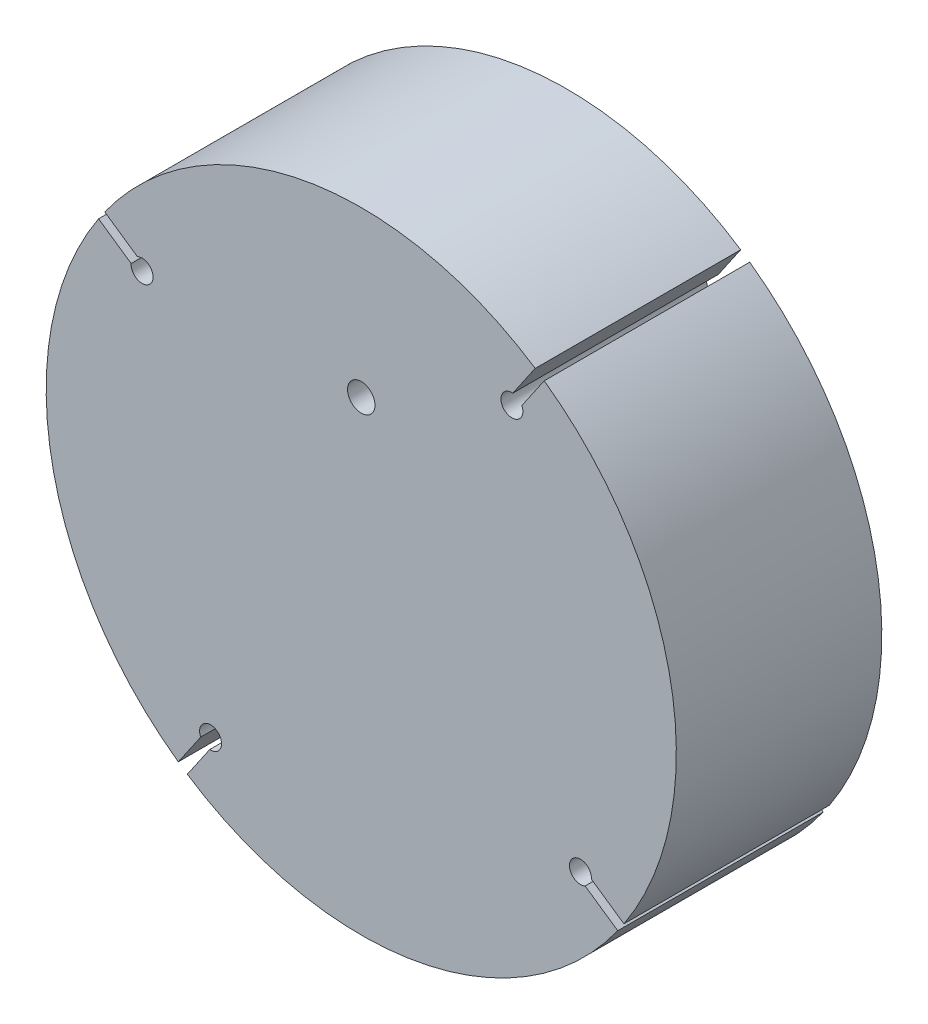
ISO-10303-21;
HEADER;
FILE_DESCRIPTION(('STEP AP214'),'2;1');
FILE_NAME('part.step','',(''),(''),'','','');
FILE_SCHEMA(('AUTOMOTIVE_DESIGN { 1 0 10303 214 1 1 1 1 }'));
ENDSEC;
DATA;
#1=APPLICATION_CONTEXT('core data for automotive mechanical design processes');
#2=APPLICATION_PROTOCOL_DEFINITION('international standard','automotive_design',2000,#1);
#3=PRODUCT_CONTEXT('',#1,'mechanical');
#4=PRODUCT('Part','Part','',(#3));
#5=PRODUCT_RELATED_PRODUCT_CATEGORY('part','',(#4));
#6=PRODUCT_DEFINITION_FORMATION('','',#4);
#7=PRODUCT_DEFINITION_CONTEXT('part definition',#1,'design');
#8=PRODUCT_DEFINITION('design','',#6,#7);
#9=PRODUCT_DEFINITION_SHAPE('','',#8);
#10=(LENGTH_UNIT() NAMED_UNIT(*) SI_UNIT(.MILLI.,.METRE.));
#11=(NAMED_UNIT(*) PLANE_ANGLE_UNIT() SI_UNIT($,.RADIAN.));
#12=(NAMED_UNIT(*) SI_UNIT($,.STERADIAN.) SOLID_ANGLE_UNIT());
#13=UNCERTAINTY_MEASURE_WITH_UNIT(LENGTH_MEASURE(1.E-05),#10,'distance_accuracy_value','');
#14=(GEOMETRIC_REPRESENTATION_CONTEXT(3) GLOBAL_UNCERTAINTY_ASSIGNED_CONTEXT((#13)) GLOBAL_UNIT_ASSIGNED_CONTEXT((#10,
#11,#12)) REPRESENTATION_CONTEXT('',''));
#15=CARTESIAN_POINT('',(0.,0.,0.));
#16=DIRECTION('',(0.,0.,1.));
#17=DIRECTION('',(1.,0.,0.));
#18=AXIS2_PLACEMENT_3D('',#15,#16,#17);
#19=CARTESIAN_POINT('',(0.,0.,75.));
#20=DIRECTION('',(0.,0.,-1.));
#21=DIRECTION('',(-1.,0.,0.));
#22=AXIS2_PLACEMENT_3D('',#19,#20,#21);
#23=CYLINDRICAL_SURFACE('',#22,115.);
#24=CARTESIAN_POINT('',(0.,0.,75.));
#25=DIRECTION('',(0.,0.,1.));
#26=DIRECTION('',(1.,0.,0.));
#27=AXIS2_PLACEMENT_3D('',#24,#25,#26);
#28=CIRCLE('',#27,115.);
#29=CARTESIAN_POINT('',(63.4928773633167,95.8835466809965,75.));
#30=VERTEX_POINT('',#29);
#31=CARTESIAN_POINT('',(-93.6174313894482,66.7890450601141,75.));
#32=VERTEX_POINT('',#31);
#33=EDGE_CURVE('E43',#30,#32,#28,.T.);
#34=ORIENTED_EDGE('',*,*,#33,.F.);
#35=DIRECTION('',(0.,0.,-1.));
#36=VECTOR('',#35,1.);
#37=CARTESIAN_POINT('',(63.4928773633167,95.8835466809965,75.001));
#38=LINE('',#37,#36);
#39=CARTESIAN_POINT('',(63.4928773633167,95.8835466809965,0.));
#40=VERTEX_POINT('',#39);
#41=EDGE_CURVE('E342',#30,#40,#38,.T.);
#42=ORIENTED_EDGE('',*,*,#41,.T.);
#43=CARTESIAN_POINT('',(0.,0.,0.));
#44=DIRECTION('',(0.,0.,1.));
#45=DIRECTION('',(1.,0.,0.));
#46=AXIS2_PLACEMENT_3D('',#43,#44,#45);
#47=CIRCLE('',#46,115.);
#48=CARTESIAN_POINT('',(-93.6174313894482,66.7890450601141,0.));
#49=VERTEX_POINT('',#48);
#50=EDGE_CURVE('E435',#40,#49,#47,.T.);
#51=ORIENTED_EDGE('',*,*,#50,.T.);
#52=DIRECTION('',(0.,0.,-1.));
#53=VECTOR('',#52,1.);
#54=CARTESIAN_POINT('',(-93.6174313894482,66.7890450601141,75.001));
#55=LINE('',#54,#53);
#56=EDGE_CURVE('E393',#32,#49,#55,.T.);
#57=ORIENTED_EDGE('',*,*,#56,.F.);
#58=EDGE_LOOP('',(#34,#42,#51,#57));
#59=FACE_BOUND('',#58,.T.);
#60=ADVANCED_FACE('F33',(#59),#23,.T.);
#61=CARTESIAN_POINT('',(-63.4928773633166,-95.8835466809965,0.));
#62=VERTEX_POINT('',#61);
#63=CARTESIAN_POINT('',(93.6174313894482,-66.7890450601141,0.));
#64=VERTEX_POINT('',#63);
#65=EDGE_CURVE('E37',#62,#64,#47,.T.);
#66=ORIENTED_EDGE('',*,*,#65,.T.);
#67=DIRECTION('',(0.,0.,-1.));
#68=VECTOR('',#67,1.);
#69=CARTESIAN_POINT('',(93.6174313894482,-66.7890450601141,75.001));
#70=LINE('',#69,#68);
#71=CARTESIAN_POINT('',(93.6174313894482,-66.7890450601141,75.));
#72=VERTEX_POINT('',#71);
#73=EDGE_CURVE('E370',#72,#64,#70,.T.);
#74=ORIENTED_EDGE('',*,*,#73,.F.);
#75=CARTESIAN_POINT('',(-63.4928773633166,-95.8835466809965,75.));
#76=VERTEX_POINT('',#75);
#77=EDGE_CURVE('E11',#76,#72,#28,.T.);
#78=ORIENTED_EDGE('',*,*,#77,.F.);
#79=DIRECTION('',(0.,0.,-1.));
#80=VECTOR('',#79,1.);
#81=CARTESIAN_POINT('',(-63.4928773633166,-95.8835466809965,75.001));
#82=LINE('',#81,#80);
#83=EDGE_CURVE('E421',#76,#62,#82,.T.);
#84=ORIENTED_EDGE('',*,*,#83,.T.);
#85=EDGE_LOOP('',(#66,#74,#78,#84));
#86=FACE_BOUND('',#85,.T.);
#87=ADVANCED_FACE('F466',(#86),#23,.T.);
#88=CARTESIAN_POINT('',(-95.8835466809965,63.4928773633167,75.));
#89=VERTEX_POINT('',#88);
#90=CARTESIAN_POINT('',(-66.7890450601141,-93.6174313894483,75.));
#91=VERTEX_POINT('',#90);
#92=EDGE_CURVE('E44',#89,#91,#28,.T.);
#93=ORIENTED_EDGE('',*,*,#92,.F.);
#94=DIRECTION('',(0.,0.,-1.));
#95=VECTOR('',#94,1.);
#96=CARTESIAN_POINT('',(-95.8835466809965,63.4928773633167,75.001));
#97=LINE('',#96,#95);
#98=CARTESIAN_POINT('',(-95.8835466809965,63.4928773633167,0.));
#99=VERTEX_POINT('',#98);
#100=EDGE_CURVE('E394',#89,#99,#97,.T.);
#101=ORIENTED_EDGE('',*,*,#100,.T.);
#102=CARTESIAN_POINT('',(-66.7890450601141,-93.6174313894483,0.));
#103=VERTEX_POINT('',#102);
#104=EDGE_CURVE('E432',#99,#103,#47,.T.);
#105=ORIENTED_EDGE('',*,*,#104,.T.);
#106=DIRECTION('',(0.,0.,-1.));
#107=VECTOR('',#106,1.);
#108=CARTESIAN_POINT('',(-66.7890450601141,-93.6174313894483,75.001));
#109=LINE('',#108,#107);
#110=EDGE_CURVE('E420',#91,#103,#109,.T.);
#111=ORIENTED_EDGE('',*,*,#110,.F.);
#112=EDGE_LOOP('',(#93,#101,#105,#111));
#113=FACE_BOUND('',#112,.T.);
#114=ADVANCED_FACE('F464',(#113),#23,.T.);
#115=CARTESIAN_POINT('',(95.8835466809965,-63.4928773633166,0.));
#116=VERTEX_POINT('',#115);
#117=CARTESIAN_POINT('',(66.7890450601142,93.6174313894482,0.));
#118=VERTEX_POINT('',#117);
#119=EDGE_CURVE('E436',#116,#118,#47,.T.);
#120=ORIENTED_EDGE('',*,*,#119,.T.);
#121=DIRECTION('',(0.,0.,-1.));
#122=VECTOR('',#121,1.);
#123=CARTESIAN_POINT('',(66.7890450601142,93.6174313894482,75.001));
#124=LINE('',#123,#122);
#125=CARTESIAN_POINT('',(66.7890450601142,93.6174313894482,75.));
#126=VERTEX_POINT('',#125);
#127=EDGE_CURVE('E341',#126,#118,#124,.T.);
#128=ORIENTED_EDGE('',*,*,#127,.F.);
#129=CARTESIAN_POINT('',(95.8835466809965,-63.4928773633166,75.));
#130=VERTEX_POINT('',#129);
#131=EDGE_CURVE('E42',#130,#126,#28,.T.);
#132=ORIENTED_EDGE('',*,*,#131,.F.);
#133=DIRECTION('',(0.,0.,-1.));
#134=VECTOR('',#133,1.);
#135=CARTESIAN_POINT('',(95.8835466809965,-63.4928773633166,75.001));
#136=LINE('',#135,#134);
#137=EDGE_CURVE('E372',#130,#116,#136,.T.);
#138=ORIENTED_EDGE('',*,*,#137,.T.);
#139=EDGE_LOOP('',(#120,#128,#132,#138));
#140=FACE_BOUND('',#139,.T.);
#141=ADVANCED_FACE('F35',(#140),#23,.T.);
#142=CARTESIAN_POINT('',(0.,0.,75.));
#143=DIRECTION('',(0.,0.,1.));
#144=DIRECTION('',(1.,0.,0.));
#145=AXIS2_PLACEMENT_3D('',#142,#143,#144);
#146=PLANE('',#145);
#147=CARTESIAN_POINT('',(0.,55.,75.));
#148=DIRECTION('',(0.,0.,-1.));
#149=DIRECTION('',(-1.,0.,0.));
#150=AXIS2_PLACEMENT_3D('',#147,#148,#149);
#151=CIRCLE('',#150,5.);
#152=CARTESIAN_POINT('',(-5.,55.,75.));
#153=VERTEX_POINT('',#152);
#154=EDGE_CURVE('E260',#153,#153,#151,.T.);
#155=ORIENTED_EDGE('',*,*,#154,.T.);
#156=EDGE_LOOP('',(#155));
#157=FACE_BOUND('',#156,.T.);
#158=DIRECTION('',(0.566528822887069,0.824041924199365,0.));
#159=VECTOR('',#158,1.);
#160=CARTESIAN_POINT('',(55.3144295619865,83.9876226063344,75.));
#161=LINE('',#160,#159);
#162=CARTESIAN_POINT('',(55.3144295619865,83.9876226063344,75.));
#163=VERTEX_POINT('',#162);
#164=EDGE_CURVE('E330',#163,#30,#161,.T.);
#165=ORIENTED_EDGE('',*,*,#164,.T.);
#166=ORIENTED_EDGE('',*,*,#33,.T.);
#167=DIRECTION('',(0.824041924199366,-0.566528822887068,0.));
#168=VECTOR('',#167,1.);
#169=CARTESIAN_POINT('',(-81.7215073147861,58.6105972587839,75.));
#170=LINE('',#169,#168);
#171=CARTESIAN_POINT('',(-81.7215073147861,58.6105972587839,75.));
#172=VERTEX_POINT('',#171);
#173=EDGE_CURVE('E397',#32,#172,#170,.T.);
#174=ORIENTED_EDGE('',*,*,#173,.T.);
#175=CARTESIAN_POINT('',(-80.,55.,75.));
#176=DIRECTION('',(0.,0.,1.));
#177=DIRECTION('',(1.,0.,0.));
#178=AXIS2_PLACEMENT_3D('',#175,#176,#177);
#179=CIRCLE('',#178,4.);
#180=CARTESIAN_POINT('',(-83.9876226063344,55.3144295619864,75.));
#181=VERTEX_POINT('',#180);
#182=EDGE_CURVE('E379',#172,#181,#179,.F.);
#183=ORIENTED_EDGE('',*,*,#182,.T.);
#184=DIRECTION('',(-0.824041924199367,0.566528822887066,0.));
#185=VECTOR('',#184,1.);
#186=CARTESIAN_POINT('',(-83.9876226063344,55.3144295619864,75.));
#187=LINE('',#186,#185);
#188=EDGE_CURVE('E382',#181,#89,#187,.T.);
#189=ORIENTED_EDGE('',*,*,#188,.T.);
#190=ORIENTED_EDGE('',*,*,#92,.T.);
#191=DIRECTION('',(0.566528822887061,0.824041924199371,0.));
#192=VECTOR('',#191,1.);
#193=CARTESIAN_POINT('',(-58.6105972587839,-81.7215073147861,75.));
#194=LINE('',#193,#192);
#195=CARTESIAN_POINT('',(-58.6105972587839,-81.7215073147861,75.));
#196=VERTEX_POINT('',#195);
#197=EDGE_CURVE('E424',#91,#196,#194,.T.);
#198=ORIENTED_EDGE('',*,*,#197,.T.);
#199=CARTESIAN_POINT('',(-55.,-80.,75.));
#200=DIRECTION('',(0.,0.,1.));
#201=DIRECTION('',(1.,0.,0.));
#202=AXIS2_PLACEMENT_3D('',#199,#200,#201);
#203=CIRCLE('',#202,4.);
#204=CARTESIAN_POINT('',(-55.3144295619865,-83.9876226063344,75.));
#205=VERTEX_POINT('',#204);
#206=EDGE_CURVE('E406',#196,#205,#203,.F.);
#207=ORIENTED_EDGE('',*,*,#206,.T.);
#208=DIRECTION('',(-0.566528822887061,-0.824041924199371,0.));
#209=VECTOR('',#208,1.);
#210=CARTESIAN_POINT('',(-55.3144295619865,-83.9876226063344,75.));
#211=LINE('',#210,#209);
#212=EDGE_CURVE('E409',#205,#76,#211,.T.);
#213=ORIENTED_EDGE('',*,*,#212,.T.);
#214=ORIENTED_EDGE('',*,*,#77,.T.);
#215=DIRECTION('',(-0.824041924199366,0.566528822887068,0.));
#216=VECTOR('',#215,1.);
#217=CARTESIAN_POINT('',(81.7215073147861,-58.6105972587839,75.));
#218=LINE('',#217,#216);
#219=CARTESIAN_POINT('',(81.7215073147861,-58.6105972587839,75.));
#220=VERTEX_POINT('',#219);
#221=EDGE_CURVE('E356',#72,#220,#218,.T.);
#222=ORIENTED_EDGE('',*,*,#221,.T.);
#223=CARTESIAN_POINT('',(80.,-55.,75.));
#224=DIRECTION('',(0.,0.,1.));
#225=DIRECTION('',(1.,0.,0.));
#226=AXIS2_PLACEMENT_3D('',#223,#224,#225);
#227=CIRCLE('',#226,4.);
#228=CARTESIAN_POINT('',(83.9876226063344,-55.3144295619864,75.));
#229=VERTEX_POINT('',#228);
#230=EDGE_CURVE('E353',#220,#229,#227,.F.);
#231=ORIENTED_EDGE('',*,*,#230,.T.);
#232=DIRECTION('',(0.824041924199367,-0.566528822887066,0.));
#233=VECTOR('',#232,1.);
#234=CARTESIAN_POINT('',(83.9876226063344,-55.3144295619864,75.));
#235=LINE('',#234,#233);
#236=EDGE_CURVE('E369',#229,#130,#235,.T.);
#237=ORIENTED_EDGE('',*,*,#236,.T.);
#238=ORIENTED_EDGE('',*,*,#131,.T.);
#239=DIRECTION('',(-0.56652882288707,-0.824041924199365,0.));
#240=VECTOR('',#239,1.);
#241=CARTESIAN_POINT('',(58.6105972587839,81.7215073147861,75.));
#242=LINE('',#241,#240);
#243=CARTESIAN_POINT('',(58.6105972587839,81.7215073147861,75.));
#244=VERTEX_POINT('',#243);
#245=EDGE_CURVE('E345',#126,#244,#242,.T.);
#246=ORIENTED_EDGE('',*,*,#245,.T.);
#247=CARTESIAN_POINT('',(55.,80.,75.));
#248=DIRECTION('',(0.,0.,1.));
#249=DIRECTION('',(1.,0.,0.));
#250=AXIS2_PLACEMENT_3D('',#247,#248,#249);
#251=CIRCLE('',#250,4.);
#252=EDGE_CURVE('E321',#244,#163,#251,.F.);
#253=ORIENTED_EDGE('',*,*,#252,.T.);
#254=EDGE_LOOP('',(#165,#166,#174,#183,#189,#190,#198,#207,#213,#214,#222,#231,#237,#238,#246,#253));
#255=FACE_BOUND('',#254,.T.);
#256=ADVANCED_FACE('F458',(#157,#255),#146,.T.);
#257=CARTESIAN_POINT('',(0.,0.,0.));
#258=DIRECTION('',(0.,0.,1.));
#259=DIRECTION('',(1.,0.,0.));
#260=AXIS2_PLACEMENT_3D('',#257,#258,#259);
#261=PLANE('',#260);
#262=DIRECTION('',(1.,0.,0.));
#263=VECTOR('',#262,1.);
#264=CARTESIAN_POINT('',(22.5,107.,0.));
#265=LINE('',#264,#263);
#266=CARTESIAN_POINT('',(-22.5,107.,0.));
#267=VERTEX_POINT('',#266);
#268=CARTESIAN_POINT('',(22.5,107.,0.));
#269=VERTEX_POINT('',#268);
#270=EDGE_CURVE('E250',#267,#269,#265,.T.);
#271=ORIENTED_EDGE('',*,*,#270,.F.);
#272=DIRECTION('',(0.,1.,0.));
#273=VECTOR('',#272,1.);
#274=CARTESIAN_POINT('',(-22.5,107.,0.));
#275=LINE('',#274,#273);
#276=CARTESIAN_POINT('',(-22.5,62.,0.));
#277=VERTEX_POINT('',#276);
#278=EDGE_CURVE('E51',#277,#267,#275,.T.);
#279=ORIENTED_EDGE('',*,*,#278,.F.);
#280=DIRECTION('',(-1.,0.,0.));
#281=VECTOR('',#280,1.);
#282=CARTESIAN_POINT('',(22.5,62.,0.));
#283=LINE('',#282,#281);
#284=CARTESIAN_POINT('',(22.5,62.,0.));
#285=VERTEX_POINT('',#284);
#286=EDGE_CURVE('E241',#285,#277,#283,.T.);
#287=ORIENTED_EDGE('',*,*,#286,.F.);
#288=DIRECTION('',(0.,-1.,0.));
#289=VECTOR('',#288,1.);
#290=CARTESIAN_POINT('',(22.5,107.,0.));
#291=LINE('',#290,#289);
#292=EDGE_CURVE('E244',#269,#285,#291,.T.);
#293=ORIENTED_EDGE('',*,*,#292,.F.);
#294=EDGE_LOOP('',(#271,#279,#287,#293));
#295=FACE_BOUND('',#294,.T.);
#296=CARTESIAN_POINT('',(0.,55.,0.));
#297=DIRECTION('',(0.,0.,-1.));
#298=DIRECTION('',(-1.,0.,0.));
#299=AXIS2_PLACEMENT_3D('',#296,#297,#298);
#300=CIRCLE('',#299,5.);
#301=CARTESIAN_POINT('',(-5.,55.,0.));
#302=VERTEX_POINT('',#301);
#303=EDGE_CURVE('E256',#302,#302,#300,.T.);
#304=ORIENTED_EDGE('',*,*,#303,.F.);
#305=EDGE_LOOP('',(#304));
#306=FACE_BOUND('',#305,.T.);
#307=DIRECTION('',(1.,0.,0.));
#308=VECTOR('',#307,1.);
#309=CARTESIAN_POINT('',(-15.,35.,0.));
#310=LINE('',#309,#308);
#311=CARTESIAN_POINT('',(-65.,35.,0.));
#312=VERTEX_POINT('',#311);
#313=CARTESIAN_POINT('',(-15.,35.,0.));
#314=VERTEX_POINT('',#313);
#315=EDGE_CURVE('E280',#312,#314,#310,.T.);
#316=ORIENTED_EDGE('',*,*,#315,.F.);
#317=DIRECTION('',(0.,1.,0.));
#318=VECTOR('',#317,1.);
#319=CARTESIAN_POINT('',(-65.,-35.,0.));
#320=LINE('',#319,#318);
#321=CARTESIAN_POINT('',(-65.,-35.,0.));
#322=VERTEX_POINT('',#321);
#323=EDGE_CURVE('E59',#322,#312,#320,.T.);
#324=ORIENTED_EDGE('',*,*,#323,.F.);
#325=DIRECTION('',(-1.,0.,0.));
#326=VECTOR('',#325,1.);
#327=CARTESIAN_POINT('',(-15.,-35.,0.));
#328=LINE('',#327,#326);
#329=CARTESIAN_POINT('',(-15.,-35.,0.));
#330=VERTEX_POINT('',#329);
#331=EDGE_CURVE('E269',#330,#322,#328,.T.);
#332=ORIENTED_EDGE('',*,*,#331,.F.);
#333=DIRECTION('',(0.,-1.,0.));
#334=VECTOR('',#333,1.);
#335=CARTESIAN_POINT('',(-15.,-35.,0.));
#336=LINE('',#335,#334);
#337=EDGE_CURVE('E283',#314,#330,#336,.T.);
#338=ORIENTED_EDGE('',*,*,#337,.F.);
#339=EDGE_LOOP('',(#316,#324,#332,#338));
#340=FACE_BOUND('',#339,.T.);
#341=DIRECTION('',(-1.,0.,0.));
#342=VECTOR('',#341,1.);
#343=CARTESIAN_POINT('',(5.,-30.,0.));
#344=LINE('',#343,#342);
#345=CARTESIAN_POINT('',(65.,-30.,0.));
#346=VERTEX_POINT('',#345);
#347=CARTESIAN_POINT('',(5.,-30.,0.));
#348=VERTEX_POINT('',#347);
#349=EDGE_CURVE('E311',#346,#348,#344,.T.);
#350=ORIENTED_EDGE('',*,*,#349,.F.);
#351=DIRECTION('',(0.,-1.,0.));
#352=VECTOR('',#351,1.);
#353=CARTESIAN_POINT('',(65.,30.,0.));
#354=LINE('',#353,#352);
#355=CARTESIAN_POINT('',(65.,30.,0.));
#356=VERTEX_POINT('',#355);
#357=EDGE_CURVE('E290',#356,#346,#354,.T.);
#358=ORIENTED_EDGE('',*,*,#357,.F.);
#359=DIRECTION('',(1.,0.,0.));
#360=VECTOR('',#359,1.);
#361=CARTESIAN_POINT('',(5.00000000000001,30.,0.));
#362=LINE('',#361,#360);
#363=CARTESIAN_POINT('',(5.00000000000001,30.,0.));
#364=VERTEX_POINT('',#363);
#365=EDGE_CURVE('E300',#364,#356,#362,.T.);
#366=ORIENTED_EDGE('',*,*,#365,.F.);
#367=DIRECTION('',(0.,1.,0.));
#368=VECTOR('',#367,1.);
#369=CARTESIAN_POINT('',(5.00000000000001,30.,0.));
#370=LINE('',#369,#368);
#371=EDGE_CURVE('E314',#348,#364,#370,.T.);
#372=ORIENTED_EDGE('',*,*,#371,.F.);
#373=EDGE_LOOP('',(#350,#358,#366,#372));
#374=FACE_BOUND('',#373,.T.);
#375=ORIENTED_EDGE('',*,*,#50,.F.);
#376=DIRECTION('',(0.566528822887069,0.824041924199365,0.));
#377=VECTOR('',#376,1.);
#378=CARTESIAN_POINT('',(55.3144295619865,83.9876226063344,0.));
#379=LINE('',#378,#377);
#380=CARTESIAN_POINT('',(55.3144295619865,83.9876226063344,0.));
#381=VERTEX_POINT('',#380);
#382=EDGE_CURVE('E339',#381,#40,#379,.T.);
#383=ORIENTED_EDGE('',*,*,#382,.F.);
#384=CARTESIAN_POINT('',(55.,80.,0.));
#385=DIRECTION('',(0.,0.,-1.));
#386=DIRECTION('',(-1.,0.,0.));
#387=AXIS2_PLACEMENT_3D('',#384,#385,#386);
#388=CIRCLE('',#387,4.);
#389=CARTESIAN_POINT('',(58.6105972587839,81.7215073147861,0.));
#390=VERTEX_POINT('',#389);
#391=EDGE_CURVE('E336',#390,#381,#388,.T.);
#392=ORIENTED_EDGE('',*,*,#391,.F.);
#393=DIRECTION('',(-0.56652882288707,-0.824041924199364,0.));
#394=VECTOR('',#393,1.);
#395=CARTESIAN_POINT('',(58.6105972587839,81.7215073147861,0.));
#396=LINE('',#395,#394);
#397=EDGE_CURVE('E333',#118,#390,#396,.T.);
#398=ORIENTED_EDGE('',*,*,#397,.F.);
#399=ORIENTED_EDGE('',*,*,#119,.F.);
#400=DIRECTION('',(0.824041924199367,-0.566528822887066,0.));
#401=VECTOR('',#400,1.);
#402=CARTESIAN_POINT('',(83.9876226063344,-55.3144295619864,0.));
#403=LINE('',#402,#401);
#404=CARTESIAN_POINT('',(83.9876226063344,-55.3144295619864,0.));
#405=VERTEX_POINT('',#404);
#406=EDGE_CURVE('E361',#405,#116,#403,.T.);
#407=ORIENTED_EDGE('',*,*,#406,.F.);
#408=CARTESIAN_POINT('',(80.,-55.,0.));
#409=DIRECTION('',(0.,0.,-1.));
#410=DIRECTION('',(-1.,0.,0.));
#411=AXIS2_PLACEMENT_3D('',#408,#409,#410);
#412=CIRCLE('',#411,4.);
#413=CARTESIAN_POINT('',(81.7215073147861,-58.6105972587839,0.));
#414=VERTEX_POINT('',#413);
#415=EDGE_CURVE('E359',#414,#405,#412,.T.);
#416=ORIENTED_EDGE('',*,*,#415,.F.);
#417=DIRECTION('',(-0.824041924199366,0.566528822887068,0.));
#418=VECTOR('',#417,1.);
#419=CARTESIAN_POINT('',(81.7215073147861,-58.6105972587839,0.));
#420=LINE('',#419,#418);
#421=EDGE_CURVE('E363',#64,#414,#420,.T.);
#422=ORIENTED_EDGE('',*,*,#421,.F.);
#423=ORIENTED_EDGE('',*,*,#65,.F.);
#424=DIRECTION('',(-0.566528822887061,-0.824041924199371,0.));
#425=VECTOR('',#424,1.);
#426=CARTESIAN_POINT('',(-55.3144295619865,-83.9876226063344,0.));
#427=LINE('',#426,#425);
#428=CARTESIAN_POINT('',(-55.3144295619865,-83.9876226063344,0.));
#429=VERTEX_POINT('',#428);
#430=EDGE_CURVE('E418',#429,#62,#427,.T.);
#431=ORIENTED_EDGE('',*,*,#430,.F.);
#432=CARTESIAN_POINT('',(-55.,-80.,0.));
#433=DIRECTION('',(0.,0.,-1.));
#434=DIRECTION('',(1.,0.,0.));
#435=AXIS2_PLACEMENT_3D('',#432,#433,#434);
#436=CIRCLE('',#435,4.);
#437=CARTESIAN_POINT('',(-58.6105972587839,-81.7215073147861,0.));
#438=VERTEX_POINT('',#437);
#439=EDGE_CURVE('E415',#438,#429,#436,.T.);
#440=ORIENTED_EDGE('',*,*,#439,.F.);
#441=DIRECTION('',(0.566528822887061,0.82404192419937,0.));
#442=VECTOR('',#441,1.);
#443=CARTESIAN_POINT('',(-58.6105972587839,-81.7215073147861,0.));
#444=LINE('',#443,#442);
#445=EDGE_CURVE('E412',#103,#438,#444,.T.);
#446=ORIENTED_EDGE('',*,*,#445,.F.);
#447=ORIENTED_EDGE('',*,*,#104,.F.);
#448=DIRECTION('',(-0.824041924199367,0.566528822887066,0.));
#449=VECTOR('',#448,1.);
#450=CARTESIAN_POINT('',(-83.9876226063344,55.3144295619864,0.));
#451=LINE('',#450,#449);
#452=CARTESIAN_POINT('',(-83.9876226063344,55.3144295619864,0.));
#453=VERTEX_POINT('',#452);
#454=EDGE_CURVE('E391',#453,#99,#451,.T.);
#455=ORIENTED_EDGE('',*,*,#454,.F.);
#456=CARTESIAN_POINT('',(-80.,55.,0.));
#457=DIRECTION('',(0.,0.,-1.));
#458=DIRECTION('',(-1.,0.,0.));
#459=AXIS2_PLACEMENT_3D('',#456,#457,#458);
#460=CIRCLE('',#459,4.);
#461=CARTESIAN_POINT('',(-81.7215073147861,58.6105972587839,0.));
#462=VERTEX_POINT('',#461);
#463=EDGE_CURVE('E388',#462,#453,#460,.T.);
#464=ORIENTED_EDGE('',*,*,#463,.F.);
#465=DIRECTION('',(0.824041924199366,-0.566528822887068,0.));
#466=VECTOR('',#465,1.);
#467=CARTESIAN_POINT('',(-81.7215073147861,58.6105972587839,0.));
#468=LINE('',#467,#466);
#469=EDGE_CURVE('E385',#49,#462,#468,.T.);
#470=ORIENTED_EDGE('',*,*,#469,.F.);
#471=EDGE_LOOP('',(#375,#383,#392,#398,#399,#407,#416,#422,#423,#431,#440,#446,#447,#455,#464,#470));
#472=FACE_BOUND('',#471,.T.);
#473=ADVANCED_FACE('F451',(#295,#306,#340,#374,#472),#261,.F.);
#474=CARTESIAN_POINT('',(-55.3144295619865,-83.9876226063344,75.001));
#475=DIRECTION('',(0.824041924199371,-0.566528822887061,0.));
#476=DIRECTION('',(0.566528822887061,0.824041924199371,0.));
#477=AXIS2_PLACEMENT_3D('',#474,#475,#476);
#478=PLANE('',#477);
#479=DIRECTION('',(0.,0.,-1.));
#480=VECTOR('',#479,1.);
#481=CARTESIAN_POINT('',(-55.3144295619865,-83.9876226063344,75.001));
#482=LINE('',#481,#480);
#483=EDGE_CURVE('E425',#205,#429,#482,.T.);
#484=ORIENTED_EDGE('',*,*,#483,.T.);
#485=ORIENTED_EDGE('',*,*,#430,.T.);
#486=ORIENTED_EDGE('',*,*,#83,.F.);
#487=ORIENTED_EDGE('',*,*,#212,.F.);
#488=EDGE_LOOP('',(#484,#485,#486,#487));
#489=FACE_BOUND('',#488,.T.);
#490=ADVANCED_FACE('F529',(#489),#478,.F.);
#491=CARTESIAN_POINT('',(-55.,-80.,75.001));
#492=DIRECTION('',(0.,0.,-1.));
#493=DIRECTION('',(-1.,0.,0.));
#494=AXIS2_PLACEMENT_3D('',#491,#492,#493);
#495=CYLINDRICAL_SURFACE('',#494,4.);
#496=DIRECTION('',(0.,0.,-1.));
#497=VECTOR('',#496,1.);
#498=CARTESIAN_POINT('',(-58.6105972587839,-81.7215073147861,75.001));
#499=LINE('',#498,#497);
#500=EDGE_CURVE('E427',#196,#438,#499,.T.);
#501=ORIENTED_EDGE('',*,*,#500,.T.);
#502=ORIENTED_EDGE('',*,*,#439,.T.);
#503=ORIENTED_EDGE('',*,*,#483,.F.);
#504=ORIENTED_EDGE('',*,*,#206,.F.);
#505=EDGE_LOOP('',(#501,#502,#503,#504));
#506=FACE_BOUND('',#505,.T.);
#507=ADVANCED_FACE('F495',(#506),#495,.F.);
#508=CARTESIAN_POINT('',(-58.6105972587839,-81.7215073147861,75.001));
#509=DIRECTION('',(-0.824041924199371,0.566528822887061,0.));
#510=DIRECTION('',(-0.566528822887061,-0.824041924199371,0.));
#511=AXIS2_PLACEMENT_3D('',#508,#509,#510);
#512=PLANE('',#511);
#513=ORIENTED_EDGE('',*,*,#110,.T.);
#514=ORIENTED_EDGE('',*,*,#445,.T.);
#515=ORIENTED_EDGE('',*,*,#500,.F.);
#516=ORIENTED_EDGE('',*,*,#197,.F.);
#517=EDGE_LOOP('',(#513,#514,#515,#516));
#518=FACE_BOUND('',#517,.T.);
#519=ADVANCED_FACE('F462',(#518),#512,.F.);
#520=CARTESIAN_POINT('',(-83.9876226063344,55.3144295619864,75.001));
#521=DIRECTION('',(-0.566528822887066,-0.824041924199367,0.));
#522=DIRECTION('',(0.824041924199367,-0.566528822887066,0.));
#523=AXIS2_PLACEMENT_3D('',#520,#521,#522);
#524=PLANE('',#523);
#525=DIRECTION('',(0.,0.,-1.));
#526=VECTOR('',#525,1.);
#527=CARTESIAN_POINT('',(-83.9876226063344,55.3144295619864,75.001));
#528=LINE('',#527,#526);
#529=EDGE_CURVE('E398',#181,#453,#528,.T.);
#530=ORIENTED_EDGE('',*,*,#529,.T.);
#531=ORIENTED_EDGE('',*,*,#454,.T.);
#532=ORIENTED_EDGE('',*,*,#100,.F.);
#533=ORIENTED_EDGE('',*,*,#188,.F.);
#534=EDGE_LOOP('',(#530,#531,#532,#533));
#535=FACE_BOUND('',#534,.T.);
#536=ADVANCED_FACE('F489',(#535),#524,.F.);
#537=CARTESIAN_POINT('',(-80.,55.,75.001));
#538=DIRECTION('',(0.,0.,-1.));
#539=DIRECTION('',(-1.,0.,0.));
#540=AXIS2_PLACEMENT_3D('',#537,#538,#539);
#541=CYLINDRICAL_SURFACE('',#540,4.);
#542=DIRECTION('',(0.,0.,-1.));
#543=VECTOR('',#542,1.);
#544=CARTESIAN_POINT('',(-81.7215073147861,58.6105972587839,75.001));
#545=LINE('',#544,#543);
#546=EDGE_CURVE('E400',#172,#462,#545,.T.);
#547=ORIENTED_EDGE('',*,*,#546,.T.);
#548=ORIENTED_EDGE('',*,*,#463,.T.);
#549=ORIENTED_EDGE('',*,*,#529,.F.);
#550=ORIENTED_EDGE('',*,*,#182,.F.);
#551=EDGE_LOOP('',(#547,#548,#549,#550));
#552=FACE_BOUND('',#551,.T.);
#553=ADVANCED_FACE('F485',(#552),#541,.F.);
#554=CARTESIAN_POINT('',(-81.7215073147861,58.6105972587839,75.001));
#555=DIRECTION('',(0.566528822887068,0.824041924199366,0.));
#556=DIRECTION('',(-0.824041924199366,0.566528822887068,0.));
#557=AXIS2_PLACEMENT_3D('',#554,#555,#556);
#558=PLANE('',#557);
#559=ORIENTED_EDGE('',*,*,#56,.T.);
#560=ORIENTED_EDGE('',*,*,#469,.T.);
#561=ORIENTED_EDGE('',*,*,#546,.F.);
#562=ORIENTED_EDGE('',*,*,#173,.F.);
#563=EDGE_LOOP('',(#559,#560,#561,#562));
#564=FACE_BOUND('',#563,.T.);
#565=ADVANCED_FACE('F481',(#564),#558,.F.);
#566=CARTESIAN_POINT('',(80.,-55.,75.001));
#567=DIRECTION('',(0.,0.,-1.));
#568=DIRECTION('',(-1.,0.,0.));
#569=AXIS2_PLACEMENT_3D('',#566,#567,#568);
#570=CYLINDRICAL_SURFACE('',#569,4.);
#571=DIRECTION('',(0.,0.,-1.));
#572=VECTOR('',#571,1.);
#573=CARTESIAN_POINT('',(81.7215073147861,-58.6105972587839,75.001));
#574=LINE('',#573,#572);
#575=EDGE_CURVE('E367',#220,#414,#574,.T.);
#576=ORIENTED_EDGE('',*,*,#575,.T.);
#577=ORIENTED_EDGE('',*,*,#415,.T.);
#578=DIRECTION('',(0.,0.,-1.));
#579=VECTOR('',#578,1.);
#580=CARTESIAN_POINT('',(83.9876226063344,-55.3144295619864,75.001));
#581=LINE('',#580,#579);
#582=EDGE_CURVE('E366',#229,#405,#581,.T.);
#583=ORIENTED_EDGE('',*,*,#582,.F.);
#584=ORIENTED_EDGE('',*,*,#230,.F.);
#585=EDGE_LOOP('',(#576,#577,#583,#584));
#586=FACE_BOUND('',#585,.T.);
#587=ADVANCED_FACE('F505',(#586),#570,.F.);
#588=CARTESIAN_POINT('',(81.7215073147861,-58.6105972587839,75.001));
#589=DIRECTION('',(-0.566528822887068,-0.824041924199366,0.));
#590=DIRECTION('',(0.824041924199366,-0.566528822887068,0.));
#591=AXIS2_PLACEMENT_3D('',#588,#589,#590);
#592=PLANE('',#591);
#593=ORIENTED_EDGE('',*,*,#73,.T.);
#594=ORIENTED_EDGE('',*,*,#421,.T.);
#595=ORIENTED_EDGE('',*,*,#575,.F.);
#596=ORIENTED_EDGE('',*,*,#221,.F.);
#597=EDGE_LOOP('',(#593,#594,#595,#596));
#598=FACE_BOUND('',#597,.T.);
#599=ADVANCED_FACE('F501',(#598),#592,.F.);
#600=CARTESIAN_POINT('',(83.9876226063344,-55.3144295619864,75.001));
#601=DIRECTION('',(0.566528822887066,0.824041924199367,0.));
#602=DIRECTION('',(-0.824041924199367,0.566528822887066,0.));
#603=AXIS2_PLACEMENT_3D('',#600,#601,#602);
#604=PLANE('',#603);
#605=ORIENTED_EDGE('',*,*,#582,.T.);
#606=ORIENTED_EDGE('',*,*,#406,.T.);
#607=ORIENTED_EDGE('',*,*,#137,.F.);
#608=ORIENTED_EDGE('',*,*,#236,.F.);
#609=EDGE_LOOP('',(#605,#606,#607,#608));
#610=FACE_BOUND('',#609,.T.);
#611=ADVANCED_FACE('F507',(#610),#604,.F.);
#612=CARTESIAN_POINT('',(55.3144295619865,83.9876226063344,75.001));
#613=DIRECTION('',(-0.824041924199365,0.566528822887069,0.));
#614=DIRECTION('',(-0.566528822887069,-0.824041924199365,0.));
#615=AXIS2_PLACEMENT_3D('',#612,#613,#614);
#616=PLANE('',#615);
#617=DIRECTION('',(0.,0.,-1.));
#618=VECTOR('',#617,1.);
#619=CARTESIAN_POINT('',(55.3144295619865,83.9876226063344,75.001));
#620=LINE('',#619,#618);
#621=EDGE_CURVE('E346',#163,#381,#620,.T.);
#622=ORIENTED_EDGE('',*,*,#621,.T.);
#623=ORIENTED_EDGE('',*,*,#382,.T.);
#624=ORIENTED_EDGE('',*,*,#41,.F.);
#625=ORIENTED_EDGE('',*,*,#164,.F.);
#626=EDGE_LOOP('',(#622,#623,#624,#625));
#627=FACE_BOUND('',#626,.T.);
#628=ADVANCED_FACE('F509',(#627),#616,.F.);
#629=CARTESIAN_POINT('',(55.,80.,75.001));
#630=DIRECTION('',(0.,0.,-1.));
#631=DIRECTION('',(-1.,0.,0.));
#632=AXIS2_PLACEMENT_3D('',#629,#630,#631);
#633=CYLINDRICAL_SURFACE('',#632,4.);
#634=DIRECTION('',(0.,0.,-1.));
#635=VECTOR('',#634,1.);
#636=CARTESIAN_POINT('',(58.6105972587839,81.7215073147861,75.001));
#637=LINE('',#636,#635);
#638=EDGE_CURVE('E348',#244,#390,#637,.T.);
#639=ORIENTED_EDGE('',*,*,#638,.T.);
#640=ORIENTED_EDGE('',*,*,#391,.T.);
#641=ORIENTED_EDGE('',*,*,#621,.F.);
#642=ORIENTED_EDGE('',*,*,#252,.F.);
#643=EDGE_LOOP('',(#639,#640,#641,#642));
#644=FACE_BOUND('',#643,.T.);
#645=ADVANCED_FACE('F515',(#644),#633,.F.);
#646=CARTESIAN_POINT('',(58.6105972587839,81.7215073147861,75.001));
#647=DIRECTION('',(0.824041924199364,-0.56652882288707,0.));
#648=DIRECTION('',(0.56652882288707,0.824041924199365,0.));
#649=AXIS2_PLACEMENT_3D('',#646,#647,#648);
#650=PLANE('',#649);
#651=ORIENTED_EDGE('',*,*,#127,.T.);
#652=ORIENTED_EDGE('',*,*,#397,.T.);
#653=ORIENTED_EDGE('',*,*,#638,.F.);
#654=ORIENTED_EDGE('',*,*,#245,.F.);
#655=EDGE_LOOP('',(#651,#652,#653,#654));
#656=FACE_BOUND('',#655,.T.);
#657=ADVANCED_FACE('F457',(#656),#650,.F.);
#658=CARTESIAN_POINT('',(65.,30.,15.));
#659=DIRECTION('',(1.,0.,0.));
#660=DIRECTION('',(0.,0.,-1.));
#661=AXIS2_PLACEMENT_3D('',#658,#659,#660);
#662=PLANE('',#661);
#663=ORIENTED_EDGE('',*,*,#357,.T.);
#664=DIRECTION('',(0.,0.,-1.));
#665=VECTOR('',#664,1.);
#666=CARTESIAN_POINT('',(65.,-30.,15.));
#667=LINE('',#666,#665);
#668=CARTESIAN_POINT('',(65.,-30.,15.));
#669=VERTEX_POINT('',#668);
#670=EDGE_CURVE('E309',#669,#346,#667,.T.);
#671=ORIENTED_EDGE('',*,*,#670,.F.);
#672=DIRECTION('',(0.,-1.,0.));
#673=VECTOR('',#672,1.);
#674=CARTESIAN_POINT('',(65.,30.,15.));
#675=LINE('',#674,#673);
#676=CARTESIAN_POINT('',(65.,30.,15.));
#677=VERTEX_POINT('',#676);
#678=EDGE_CURVE('E296',#677,#669,#675,.T.);
#679=ORIENTED_EDGE('',*,*,#678,.F.);
#680=DIRECTION('',(0.,0.,-1.));
#681=VECTOR('',#680,1.);
#682=CARTESIAN_POINT('',(65.,30.,15.));
#683=LINE('',#682,#681);
#684=EDGE_CURVE('E319',#677,#356,#683,.T.);
#685=ORIENTED_EDGE('',*,*,#684,.T.);
#686=EDGE_LOOP('',(#663,#671,#679,#685));
#687=FACE_BOUND('',#686,.T.);
#688=ADVANCED_FACE('F559',(#687),#662,.F.);
#689=CARTESIAN_POINT('',(5.00000000000001,30.,15.));
#690=DIRECTION('',(0.,1.,0.));
#691=DIRECTION('',(-1.,0.,0.));
#692=AXIS2_PLACEMENT_3D('',#689,#690,#691);
#693=PLANE('',#692);
#694=ORIENTED_EDGE('',*,*,#365,.T.);
#695=ORIENTED_EDGE('',*,*,#684,.F.);
#696=DIRECTION('',(1.,0.,0.));
#697=VECTOR('',#696,1.);
#698=CARTESIAN_POINT('',(5.00000000000001,30.,15.));
#699=LINE('',#698,#697);
#700=CARTESIAN_POINT('',(5.00000000000001,30.,15.));
#701=VERTEX_POINT('',#700);
#702=EDGE_CURVE('E306',#701,#677,#699,.T.);
#703=ORIENTED_EDGE('',*,*,#702,.F.);
#704=DIRECTION('',(0.,0.,-1.));
#705=VECTOR('',#704,1.);
#706=CARTESIAN_POINT('',(5.00000000000001,30.,15.));
#707=LINE('',#706,#705);
#708=EDGE_CURVE('E322',#701,#364,#707,.T.);
#709=ORIENTED_EDGE('',*,*,#708,.T.);
#710=EDGE_LOOP('',(#694,#695,#703,#709));
#711=FACE_BOUND('',#710,.T.);
#712=ADVANCED_FACE('F562',(#711),#693,.F.);
#713=CARTESIAN_POINT('',(5.00000000000001,30.,15.));
#714=DIRECTION('',(-1.,0.,0.));
#715=DIRECTION('',(0.,-1.,0.));
#716=AXIS2_PLACEMENT_3D('',#713,#714,#715);
#717=PLANE('',#716);
#718=ORIENTED_EDGE('',*,*,#371,.T.);
#719=ORIENTED_EDGE('',*,*,#708,.F.);
#720=DIRECTION('',(0.,1.,0.));
#721=VECTOR('',#720,1.);
#722=CARTESIAN_POINT('',(5.00000000000001,30.,15.));
#723=LINE('',#722,#721);
#724=CARTESIAN_POINT('',(5.,-30.,15.));
#725=VERTEX_POINT('',#724);
#726=EDGE_CURVE('E303',#725,#701,#723,.T.);
#727=ORIENTED_EDGE('',*,*,#726,.F.);
#728=DIRECTION('',(0.,0.,-1.));
#729=VECTOR('',#728,1.);
#730=CARTESIAN_POINT('',(5.,-30.,15.));
#731=LINE('',#730,#729);
#732=EDGE_CURVE('E324',#725,#348,#731,.T.);
#733=ORIENTED_EDGE('',*,*,#732,.T.);
#734=EDGE_LOOP('',(#718,#719,#727,#733));
#735=FACE_BOUND('',#734,.T.);
#736=ADVANCED_FACE('F564',(#735),#717,.F.);
#737=CARTESIAN_POINT('',(5.,-30.,15.));
#738=DIRECTION('',(0.,-1.,0.));
#739=DIRECTION('',(1.,0.,0.));
#740=AXIS2_PLACEMENT_3D('',#737,#738,#739);
#741=PLANE('',#740);
#742=ORIENTED_EDGE('',*,*,#349,.T.);
#743=ORIENTED_EDGE('',*,*,#732,.F.);
#744=DIRECTION('',(-1.,0.,0.));
#745=VECTOR('',#744,1.);
#746=CARTESIAN_POINT('',(5.,-30.,15.));
#747=LINE('',#746,#745);
#748=EDGE_CURVE('E299',#669,#725,#747,.T.);
#749=ORIENTED_EDGE('',*,*,#748,.F.);
#750=ORIENTED_EDGE('',*,*,#670,.T.);
#751=EDGE_LOOP('',(#742,#743,#749,#750));
#752=FACE_BOUND('',#751,.T.);
#753=ADVANCED_FACE('F554',(#752),#741,.F.);
#754=CARTESIAN_POINT('',(0.,0.,15.));
#755=DIRECTION('',(0.,0.,1.));
#756=DIRECTION('',(1.,0.,0.));
#757=AXIS2_PLACEMENT_3D('',#754,#755,#756);
#758=PLANE('',#757);
#759=ORIENTED_EDGE('',*,*,#678,.T.);
#760=ORIENTED_EDGE('',*,*,#748,.T.);
#761=ORIENTED_EDGE('',*,*,#726,.T.);
#762=ORIENTED_EDGE('',*,*,#702,.T.);
#763=EDGE_LOOP('',(#759,#760,#761,#762));
#764=FACE_BOUND('',#763,.T.);
#765=ADVANCED_FACE('F566',(#764),#758,.F.);
#766=CARTESIAN_POINT('',(-65.,-35.,25.));
#767=DIRECTION('',(-1.,0.,0.));
#768=DIRECTION('',(0.,0.,1.));
#769=AXIS2_PLACEMENT_3D('',#766,#767,#768);
#770=PLANE('',#769);
#771=ORIENTED_EDGE('',*,*,#323,.T.);
#772=DIRECTION('',(0.,0.,-1.));
#773=VECTOR('',#772,1.);
#774=CARTESIAN_POINT('',(-65.,35.,25.));
#775=LINE('',#774,#773);
#776=CARTESIAN_POINT('',(-65.,35.,25.));
#777=VERTEX_POINT('',#776);
#778=EDGE_CURVE('E278',#777,#312,#775,.T.);
#779=ORIENTED_EDGE('',*,*,#778,.F.);
#780=DIRECTION('',(0.,1.,0.));
#781=VECTOR('',#780,1.);
#782=CARTESIAN_POINT('',(-65.,-35.,25.));
#783=LINE('',#782,#781);
#784=CARTESIAN_POINT('',(-65.,-35.,25.));
#785=VERTEX_POINT('',#784);
#786=EDGE_CURVE('E265',#785,#777,#783,.T.);
#787=ORIENTED_EDGE('',*,*,#786,.F.);
#788=DIRECTION('',(0.,0.,-1.));
#789=VECTOR('',#788,1.);
#790=CARTESIAN_POINT('',(-65.,-35.,25.));
#791=LINE('',#790,#789);
#792=EDGE_CURVE('E288',#785,#322,#791,.T.);
#793=ORIENTED_EDGE('',*,*,#792,.T.);
#794=EDGE_LOOP('',(#771,#779,#787,#793));
#795=FACE_BOUND('',#794,.T.);
#796=ADVANCED_FACE('F568',(#795),#770,.F.);
#797=CARTESIAN_POINT('',(-15.,-35.,25.));
#798=DIRECTION('',(0.,-1.,0.));
#799=DIRECTION('',(0.,0.,-1.));
#800=AXIS2_PLACEMENT_3D('',#797,#798,#799);
#801=PLANE('',#800);
#802=ORIENTED_EDGE('',*,*,#331,.T.);
#803=ORIENTED_EDGE('',*,*,#792,.F.);
#804=DIRECTION('',(-1.,0.,0.));
#805=VECTOR('',#804,1.);
#806=CARTESIAN_POINT('',(-15.,-35.,25.));
#807=LINE('',#806,#805);
#808=CARTESIAN_POINT('',(-15.,-35.,25.));
#809=VERTEX_POINT('',#808);
#810=EDGE_CURVE('E275',#809,#785,#807,.T.);
#811=ORIENTED_EDGE('',*,*,#810,.F.);
#812=DIRECTION('',(0.,0.,-1.));
#813=VECTOR('',#812,1.);
#814=CARTESIAN_POINT('',(-15.,-35.,25.));
#815=LINE('',#814,#813);
#816=EDGE_CURVE('E291',#809,#330,#815,.T.);
#817=ORIENTED_EDGE('',*,*,#816,.T.);
#818=EDGE_LOOP('',(#802,#803,#811,#817));
#819=FACE_BOUND('',#818,.T.);
#820=ADVANCED_FACE('F574',(#819),#801,.F.);
#821=CARTESIAN_POINT('',(-15.,-35.,25.));
#822=DIRECTION('',(1.,0.,0.));
#823=DIRECTION('',(0.,0.,-1.));
#824=AXIS2_PLACEMENT_3D('',#821,#822,#823);
#825=PLANE('',#824);
#826=ORIENTED_EDGE('',*,*,#337,.T.);
#827=ORIENTED_EDGE('',*,*,#816,.F.);
#828=DIRECTION('',(0.,-1.,0.));
#829=VECTOR('',#828,1.);
#830=CARTESIAN_POINT('',(-15.,-35.,25.));
#831=LINE('',#830,#829);
#832=CARTESIAN_POINT('',(-15.,35.,25.));
#833=VERTEX_POINT('',#832);
#834=EDGE_CURVE('E272',#833,#809,#831,.T.);
#835=ORIENTED_EDGE('',*,*,#834,.F.);
#836=DIRECTION('',(0.,0.,-1.));
#837=VECTOR('',#836,1.);
#838=CARTESIAN_POINT('',(-15.,35.,25.));
#839=LINE('',#838,#837);
#840=EDGE_CURVE('E293',#833,#314,#839,.T.);
#841=ORIENTED_EDGE('',*,*,#840,.T.);
#842=EDGE_LOOP('',(#826,#827,#835,#841));
#843=FACE_BOUND('',#842,.T.);
#844=ADVANCED_FACE('F627',(#843),#825,.F.);
#845=CARTESIAN_POINT('',(-15.,35.,25.));
#846=DIRECTION('',(0.,1.,0.));
#847=DIRECTION('',(0.,0.,1.));
#848=AXIS2_PLACEMENT_3D('',#845,#846,#847);
#849=PLANE('',#848);
#850=ORIENTED_EDGE('',*,*,#315,.T.);
#851=ORIENTED_EDGE('',*,*,#840,.F.);
#852=DIRECTION('',(1.,0.,0.));
#853=VECTOR('',#852,1.);
#854=CARTESIAN_POINT('',(-15.,35.,25.));
#855=LINE('',#854,#853);
#856=EDGE_CURVE('E268',#777,#833,#855,.T.);
#857=ORIENTED_EDGE('',*,*,#856,.F.);
#858=ORIENTED_EDGE('',*,*,#778,.T.);
#859=EDGE_LOOP('',(#850,#851,#857,#858));
#860=FACE_BOUND('',#859,.T.);
#861=ADVANCED_FACE('F637',(#860),#849,.F.);
#862=CARTESIAN_POINT('',(0.,0.,25.));
#863=DIRECTION('',(0.,0.,1.));
#864=DIRECTION('',(1.,0.,0.));
#865=AXIS2_PLACEMENT_3D('',#862,#863,#864);
#866=PLANE('',#865);
#867=ORIENTED_EDGE('',*,*,#786,.T.);
#868=ORIENTED_EDGE('',*,*,#856,.T.);
#869=ORIENTED_EDGE('',*,*,#834,.T.);
#870=ORIENTED_EDGE('',*,*,#810,.T.);
#871=EDGE_LOOP('',(#867,#868,#869,#870));
#872=FACE_BOUND('',#871,.T.);
#873=ADVANCED_FACE('F647',(#872),#866,.F.);
#874=CARTESIAN_POINT('',(0.,55.,75.));
#875=DIRECTION('',(0.,0.,-1.));
#876=DIRECTION('',(-1.,0.,0.));
#877=AXIS2_PLACEMENT_3D('',#874,#875,#876);
#878=CYLINDRICAL_SURFACE('',#877,5.);
#879=ORIENTED_EDGE('',*,*,#154,.F.);
#880=EDGE_LOOP('',(#879));
#881=FACE_BOUND('',#880,.T.);
#882=ORIENTED_EDGE('',*,*,#303,.T.);
#883=EDGE_LOOP('',(#882));
#884=FACE_BOUND('',#883,.T.);
#885=ADVANCED_FACE('F656',(#881,#884),#878,.F.);
#886=CARTESIAN_POINT('',(-22.5,107.,12.));
#887=DIRECTION('',(-1.,0.,0.));
#888=DIRECTION('',(0.,-1.,0.));
#889=AXIS2_PLACEMENT_3D('',#886,#887,#888);
#890=PLANE('',#889);
#891=ORIENTED_EDGE('',*,*,#278,.T.);
#892=DIRECTION('',(0.,0.,-1.));
#893=VECTOR('',#892,1.);
#894=CARTESIAN_POINT('',(-22.5,107.,12.));
#895=LINE('',#894,#893);
#896=CARTESIAN_POINT('',(-22.5,107.,12.));
#897=VERTEX_POINT('',#896);
#898=EDGE_CURVE('E219',#897,#267,#895,.T.);
#899=ORIENTED_EDGE('',*,*,#898,.F.);
#900=DIRECTION('',(0.,1.,0.));
#901=VECTOR('',#900,1.);
#902=CARTESIAN_POINT('',(-22.5,107.,12.));
#903=LINE('',#902,#901);
#904=CARTESIAN_POINT('',(-22.5,62.,12.));
#905=VERTEX_POINT('',#904);
#906=EDGE_CURVE('E223',#905,#897,#903,.T.);
#907=ORIENTED_EDGE('',*,*,#906,.F.);
#908=DIRECTION('',(0.,0.,-1.));
#909=VECTOR('',#908,1.);
#910=CARTESIAN_POINT('',(-22.5,62.,12.));
#911=LINE('',#910,#909);
#912=EDGE_CURVE('E254',#905,#277,#911,.T.);
#913=ORIENTED_EDGE('',*,*,#912,.T.);
#914=EDGE_LOOP('',(#891,#899,#907,#913));
#915=FACE_BOUND('',#914,.T.);
#916=ADVANCED_FACE('F221',(#915),#890,.F.);
#917=CARTESIAN_POINT('',(22.5,62.,12.));
#918=DIRECTION('',(0.,-1.,0.));
#919=DIRECTION('',(0.,0.,-1.));
#920=AXIS2_PLACEMENT_3D('',#917,#918,#919);
#921=PLANE('',#920);
#922=ORIENTED_EDGE('',*,*,#286,.T.);
#923=ORIENTED_EDGE('',*,*,#912,.F.);
#924=DIRECTION('',(-1.,0.,0.));
#925=VECTOR('',#924,1.);
#926=CARTESIAN_POINT('',(22.5,62.,12.));
#927=LINE('',#926,#925);
#928=CARTESIAN_POINT('',(22.5,62.,12.));
#929=VERTEX_POINT('',#928);
#930=EDGE_CURVE('E229',#929,#905,#927,.T.);
#931=ORIENTED_EDGE('',*,*,#930,.F.);
#932=DIRECTION('',(0.,0.,-1.));
#933=VECTOR('',#932,1.);
#934=CARTESIAN_POINT('',(22.5,62.,12.));
#935=LINE('',#934,#933);
#936=EDGE_CURVE('E257',#929,#285,#935,.T.);
#937=ORIENTED_EDGE('',*,*,#936,.T.);
#938=EDGE_LOOP('',(#922,#923,#931,#937));
#939=FACE_BOUND('',#938,.T.);
#940=ADVANCED_FACE('F687',(#939),#921,.F.);
#941=CARTESIAN_POINT('',(22.5,107.,12.));
#942=DIRECTION('',(1.,0.,0.));
#943=DIRECTION('',(0.,1.,0.));
#944=AXIS2_PLACEMENT_3D('',#941,#942,#943);
#945=PLANE('',#944);
#946=ORIENTED_EDGE('',*,*,#292,.T.);
#947=ORIENTED_EDGE('',*,*,#936,.F.);
#948=DIRECTION('',(0.,-1.,0.));
#949=VECTOR('',#948,1.);
#950=CARTESIAN_POINT('',(22.5,107.,12.));
#951=LINE('',#950,#949);
#952=CARTESIAN_POINT('',(22.5,107.,12.));
#953=VERTEX_POINT('',#952);
#954=EDGE_CURVE('E237',#953,#929,#951,.T.);
#955=ORIENTED_EDGE('',*,*,#954,.F.);
#956=DIRECTION('',(0.,0.,-1.));
#957=VECTOR('',#956,1.);
#958=CARTESIAN_POINT('',(22.5,107.,12.));
#959=LINE('',#958,#957);
#960=EDGE_CURVE('E228',#953,#269,#959,.T.);
#961=ORIENTED_EDGE('',*,*,#960,.T.);
#962=EDGE_LOOP('',(#946,#947,#955,#961));
#963=FACE_BOUND('',#962,.T.);
#964=ADVANCED_FACE('F696',(#963),#945,.F.);
#965=CARTESIAN_POINT('',(22.5,107.,12.));
#966=DIRECTION('',(0.,1.,0.));
#967=DIRECTION('',(0.,0.,1.));
#968=AXIS2_PLACEMENT_3D('',#965,#966,#967);
#969=PLANE('',#968);
#970=ORIENTED_EDGE('',*,*,#270,.T.);
#971=ORIENTED_EDGE('',*,*,#960,.F.);
#972=DIRECTION('',(1.,0.,0.));
#973=VECTOR('',#972,1.);
#974=CARTESIAN_POINT('',(22.5,107.,12.));
#975=LINE('',#974,#973);
#976=EDGE_CURVE('E232',#897,#953,#975,.T.);
#977=ORIENTED_EDGE('',*,*,#976,.F.);
#978=ORIENTED_EDGE('',*,*,#898,.T.);
#979=EDGE_LOOP('',(#970,#971,#977,#978));
#980=FACE_BOUND('',#979,.T.);
#981=ADVANCED_FACE('F233',(#980),#969,.F.);
#982=CARTESIAN_POINT('',(0.,0.,12.));
#983=DIRECTION('',(0.,0.,-1.));
#984=DIRECTION('',(-1.,0.,0.));
#985=AXIS2_PLACEMENT_3D('',#982,#983,#984);
#986=PLANE('',#985);
#987=ORIENTED_EDGE('',*,*,#906,.T.);
#988=ORIENTED_EDGE('',*,*,#976,.T.);
#989=ORIENTED_EDGE('',*,*,#954,.T.);
#990=ORIENTED_EDGE('',*,*,#930,.T.);
#991=EDGE_LOOP('',(#987,#988,#989,#990));
#992=FACE_BOUND('',#991,.T.);
#993=ADVANCED_FACE('F239',(#992),#986,.T.);
#994=CLOSED_SHELL('',(#60,#87,#114,#141,#256,#473,#490,#507,#519,#536,#553,#565,#587,#599,#611,
#628,#645,#657,#688,#712,#736,#753,#765,#796,#820,#844,#861,#873,#885,#916,#940,#964,#981,#993));
#995=MANIFOLD_SOLID_BREP('B2',#994);
#996=ADVANCED_BREP_SHAPE_REPRESENTATION('',(#18,#995),#14);
#997=SHAPE_DEFINITION_REPRESENTATION(#9,#996);
ENDSEC;
END-ISO-10303-21;
